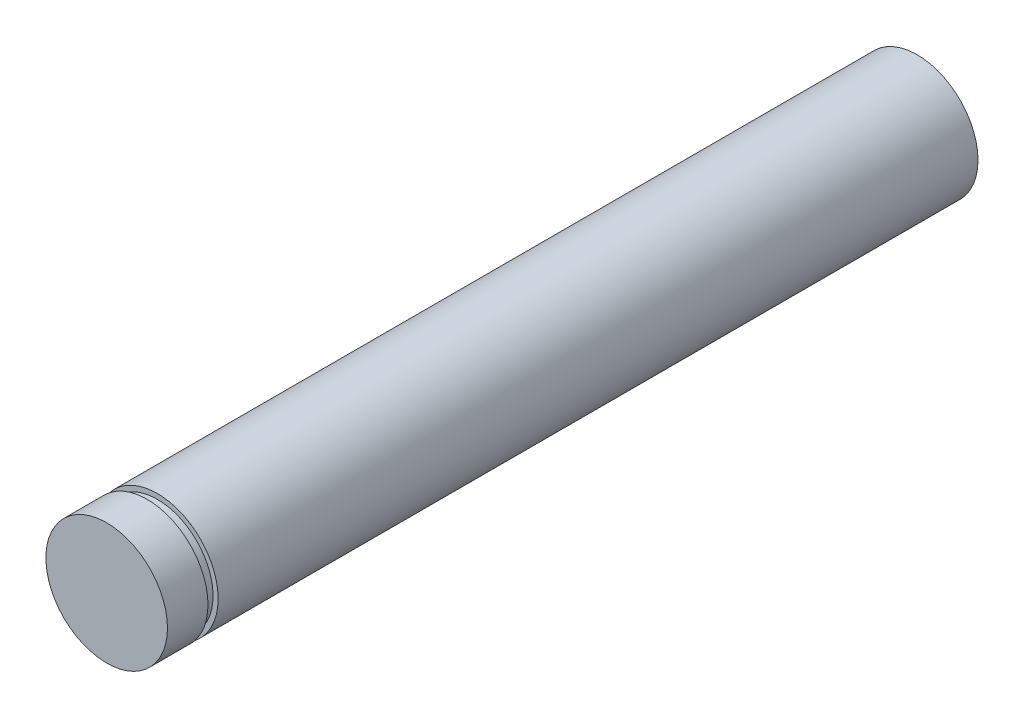
ISO-10303-21;
HEADER;
FILE_DESCRIPTION(('STEP AP214'),'2;1');
FILE_NAME('part.step','',(''),(''),'','','');
FILE_SCHEMA(('AUTOMOTIVE_DESIGN { 1 0 10303 214 1 1 1 1 }'));
ENDSEC;
DATA;
#1=APPLICATION_CONTEXT('core data for automotive mechanical design processes');
#2=APPLICATION_PROTOCOL_DEFINITION('international standard','automotive_design',2000,#1);
#3=PRODUCT_CONTEXT('',#1,'mechanical');
#4=PRODUCT('Part','Part','',(#3));
#5=PRODUCT_RELATED_PRODUCT_CATEGORY('part','',(#4));
#6=PRODUCT_DEFINITION_FORMATION('','',#4);
#7=PRODUCT_DEFINITION_CONTEXT('part definition',#1,'design');
#8=PRODUCT_DEFINITION('design','',#6,#7);
#9=PRODUCT_DEFINITION_SHAPE('','',#8);
#10=(LENGTH_UNIT() NAMED_UNIT(*) SI_UNIT(.MILLI.,.METRE.));
#11=(NAMED_UNIT(*) PLANE_ANGLE_UNIT() SI_UNIT($,.RADIAN.));
#12=(NAMED_UNIT(*) SI_UNIT($,.STERADIAN.) SOLID_ANGLE_UNIT());
#13=UNCERTAINTY_MEASURE_WITH_UNIT(LENGTH_MEASURE(1.E-05),#10,'distance_accuracy_value','');
#14=(GEOMETRIC_REPRESENTATION_CONTEXT(3) GLOBAL_UNCERTAINTY_ASSIGNED_CONTEXT((#13)) GLOBAL_UNIT_ASSIGNED_CONTEXT((#10,
#11,#12)) REPRESENTATION_CONTEXT('',''));
#15=CARTESIAN_POINT('',(0.,0.,0.));
#16=DIRECTION('',(0.,0.,1.));
#17=DIRECTION('',(1.,0.,0.));
#18=AXIS2_PLACEMENT_3D('',#15,#16,#17);
#19=CARTESIAN_POINT('',(0.,0.,-10.));
#20=DIRECTION('',(0.,0.,1.));
#21=DIRECTION('',(1.,0.,0.));
#22=AXIS2_PLACEMENT_3D('',#19,#20,#21);
#23=CYLINDRICAL_SURFACE('',#22,6.);
#24=CARTESIAN_POINT('',(0.,0.,70.));
#25=DIRECTION('',(0.,0.,1.));
#26=DIRECTION('',(1.,0.,0.));
#27=AXIS2_PLACEMENT_3D('',#24,#25,#26);
#28=CIRCLE('',#27,6.);
#29=CARTESIAN_POINT('',(6.,0.,70.));
#30=VERTEX_POINT('',#29);
#31=EDGE_CURVE('E39',#30,#30,#28,.T.);
#32=ORIENTED_EDGE('',*,*,#31,.F.);
#33=EDGE_LOOP('',(#32));
#34=FACE_BOUND('',#33,.T.);
#35=CARTESIAN_POINT('',(0.,0.,66.));
#36=DIRECTION('',(0.,0.,1.));
#37=DIRECTION('',(0.,-1.,0.));
#38=AXIS2_PLACEMENT_3D('',#35,#36,#37);
#39=CIRCLE('',#38,6.);
#40=CARTESIAN_POINT('',(0.,-6.,66.));
#41=VERTEX_POINT('',#40);
#42=EDGE_CURVE('E43',#41,#41,#39,.T.);
#43=ORIENTED_EDGE('',*,*,#42,.T.);
#44=EDGE_LOOP('',(#43));
#45=FACE_BOUND('',#44,.T.);
#46=ADVANCED_FACE('F33',(#34,#45),#23,.T.);
#47=CARTESIAN_POINT('',(0.,0.,70.));
#48=DIRECTION('',(0.,0.,1.));
#49=DIRECTION('',(1.,0.,0.));
#50=AXIS2_PLACEMENT_3D('',#47,#48,#49);
#51=PLANE('',#50);
#52=ORIENTED_EDGE('',*,*,#31,.T.);
#53=EDGE_LOOP('',(#52));
#54=FACE_BOUND('',#53,.T.);
#55=ADVANCED_FACE('F77',(#54),#51,.T.);
#56=CARTESIAN_POINT('',(0.,5.5,66.));
#57=DIRECTION('',(0.,0.,-1.));
#58=DIRECTION('',(0.,1.,0.));
#59=AXIS2_PLACEMENT_3D('',#56,#57,#58);
#60=PLANE('',#59);
#61=CARTESIAN_POINT('',(0.,0.,66.));
#62=DIRECTION('',(0.,0.,1.));
#63=DIRECTION('',(0.,-1.,0.));
#64=AXIS2_PLACEMENT_3D('',#61,#62,#63);
#65=CIRCLE('',#64,5.5);
#66=CARTESIAN_POINT('',(0.,-5.5,66.));
#67=VERTEX_POINT('',#66);
#68=EDGE_CURVE('E55',#67,#67,#65,.T.);
#69=ORIENTED_EDGE('',*,*,#68,.T.);
#70=EDGE_LOOP('',(#69));
#71=FACE_BOUND('',#70,.T.);
#72=ORIENTED_EDGE('',*,*,#42,.F.);
#73=EDGE_LOOP('',(#72));
#74=FACE_BOUND('',#73,.T.);
#75=ADVANCED_FACE('F59',(#71,#74),#60,.T.);
#76=CARTESIAN_POINT('',(0.,6.,65.));
#77=DIRECTION('',(0.,0.,1.));
#78=DIRECTION('',(0.,-1.,0.));
#79=AXIS2_PLACEMENT_3D('',#76,#77,#78);
#80=PLANE('',#79);
#81=CARTESIAN_POINT('',(0.,0.,65.));
#82=DIRECTION('',(0.,0.,1.));
#83=DIRECTION('',(0.,-1.,0.));
#84=AXIS2_PLACEMENT_3D('',#81,#82,#83);
#85=CIRCLE('',#84,6.);
#86=CARTESIAN_POINT('',(0.,-6.,65.));
#87=VERTEX_POINT('',#86);
#88=EDGE_CURVE('E47',#87,#87,#85,.T.);
#89=ORIENTED_EDGE('',*,*,#88,.T.);
#90=EDGE_LOOP('',(#89));
#91=FACE_BOUND('',#90,.T.);
#92=CARTESIAN_POINT('',(0.,0.,65.));
#93=DIRECTION('',(0.,0.,1.));
#94=DIRECTION('',(0.,-1.,0.));
#95=AXIS2_PLACEMENT_3D('',#92,#93,#94);
#96=CIRCLE('',#95,5.5);
#97=CARTESIAN_POINT('',(0.,-5.5,65.));
#98=VERTEX_POINT('',#97);
#99=EDGE_CURVE('E52',#98,#98,#96,.T.);
#100=ORIENTED_EDGE('',*,*,#99,.F.);
#101=EDGE_LOOP('',(#100));
#102=FACE_BOUND('',#101,.T.);
#103=ADVANCED_FACE('F65',(#91,#102),#80,.T.);
#104=CARTESIAN_POINT('',(0.,0.,70.));
#105=DIRECTION('',(0.,0.,1.));
#106=DIRECTION('',(0.,-1.,0.));
#107=AXIS2_PLACEMENT_3D('',#104,#105,#106);
#108=CYLINDRICAL_SURFACE('',#107,5.5);
#109=ORIENTED_EDGE('',*,*,#99,.T.);
#110=EDGE_LOOP('',(#109));
#111=FACE_BOUND('',#110,.T.);
#112=ORIENTED_EDGE('',*,*,#68,.F.);
#113=EDGE_LOOP('',(#112));
#114=FACE_BOUND('',#113,.T.);
#115=ADVANCED_FACE('F62',(#111,#114),#108,.T.);
#116=CARTESIAN_POINT('',(0.,0.,-10.));
#117=DIRECTION('',(0.,0.,1.));
#118=DIRECTION('',(1.,0.,0.));
#119=AXIS2_PLACEMENT_3D('',#116,#117,#118);
#120=PLANE('',#119);
#121=CARTESIAN_POINT('',(0.,0.,-10.));
#122=DIRECTION('',(0.,0.,1.));
#123=DIRECTION('',(1.,0.,0.));
#124=AXIS2_PLACEMENT_3D('',#121,#122,#123);
#125=CIRCLE('',#124,6.);
#126=CARTESIAN_POINT('',(6.,0.,-10.));
#127=VERTEX_POINT('',#126);
#128=EDGE_CURVE('E10',#127,#127,#125,.T.);
#129=ORIENTED_EDGE('',*,*,#128,.F.);
#130=EDGE_LOOP('',(#129));
#131=FACE_BOUND('',#130,.T.);
#132=ADVANCED_FACE('F64',(#131),#120,.F.);
#133=ORIENTED_EDGE('',*,*,#128,.T.);
#134=EDGE_LOOP('',(#133));
#135=FACE_BOUND('',#134,.T.);
#136=ORIENTED_EDGE('',*,*,#88,.F.);
#137=EDGE_LOOP('',(#136));
#138=FACE_BOUND('',#137,.T.);
#139=ADVANCED_FACE('F72',(#135,#138),#23,.T.);
#140=CLOSED_SHELL('',(#46,#55,#75,#103,#115,#132,#139));
#141=MANIFOLD_SOLID_BREP('B2',#140);
#142=ADVANCED_BREP_SHAPE_REPRESENTATION('',(#18,#141),#14);
#143=SHAPE_DEFINITION_REPRESENTATION(#9,#142);
ENDSEC;
END-ISO-10303-21;
